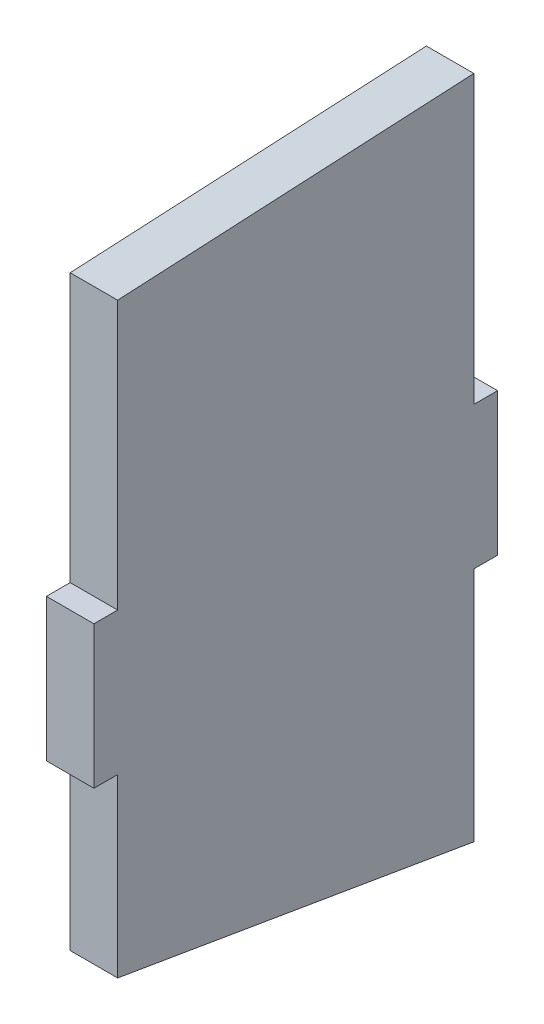
ISO-10303-21;
HEADER;
FILE_DESCRIPTION(('STEP AP214'),'2;1');
FILE_NAME('part.step','',(''),(''),'','','');
FILE_SCHEMA(('AUTOMOTIVE_DESIGN { 1 0 10303 214 1 1 1 1 }'));
ENDSEC;
DATA;
#1=APPLICATION_CONTEXT('core data for automotive mechanical design processes');
#2=APPLICATION_PROTOCOL_DEFINITION('international standard','automotive_design',2000,#1);
#3=PRODUCT_CONTEXT('',#1,'mechanical');
#4=PRODUCT('Part','Part','',(#3));
#5=PRODUCT_RELATED_PRODUCT_CATEGORY('part','',(#4));
#6=PRODUCT_DEFINITION_FORMATION('','',#4);
#7=PRODUCT_DEFINITION_CONTEXT('part definition',#1,'design');
#8=PRODUCT_DEFINITION('design','',#6,#7);
#9=PRODUCT_DEFINITION_SHAPE('','',#8);
#10=(LENGTH_UNIT() NAMED_UNIT(*) SI_UNIT(.MILLI.,.METRE.));
#11=(NAMED_UNIT(*) PLANE_ANGLE_UNIT() SI_UNIT($,.RADIAN.));
#12=(NAMED_UNIT(*) SI_UNIT($,.STERADIAN.) SOLID_ANGLE_UNIT());
#13=UNCERTAINTY_MEASURE_WITH_UNIT(LENGTH_MEASURE(1.E-05),#10,'distance_accuracy_value','');
#14=(GEOMETRIC_REPRESENTATION_CONTEXT(3) GLOBAL_UNCERTAINTY_ASSIGNED_CONTEXT((#13)) GLOBAL_UNIT_ASSIGNED_CONTEXT((#10,
#11,#12)) REPRESENTATION_CONTEXT('',''));
#15=CARTESIAN_POINT('',(0.,0.,0.));
#16=DIRECTION('',(0.,0.,1.));
#17=DIRECTION('',(1.,0.,0.));
#18=AXIS2_PLACEMENT_3D('',#15,#16,#17);
#19=CARTESIAN_POINT('',(25.4,0.,95.25));
#20=DIRECTION('',(0.,0.,1.));
#21=DIRECTION('',(1.,0.,0.));
#22=AXIS2_PLACEMENT_3D('',#19,#20,#21);
#23=PLANE('',#22);
#24=DIRECTION('',(0.,1.,0.));
#25=VECTOR('',#24,1.);
#26=CARTESIAN_POINT('',(0.,0.,95.25));
#27=LINE('',#26,#25);
#28=CARTESIAN_POINT('',(0.,38.1,95.25));
#29=VERTEX_POINT('',#28);
#30=CARTESIAN_POINT('',(0.,181.62487678,95.25));
#31=VERTEX_POINT('',#30);
#32=EDGE_CURVE('E159',#29,#31,#27,.T.);
#33=ORIENTED_EDGE('',*,*,#32,.F.);
#34=DIRECTION('',(-1.,0.,0.));
#35=VECTOR('',#34,1.);
#36=CARTESIAN_POINT('',(25.4,38.1,95.25));
#37=LINE('',#36,#35);
#38=CARTESIAN_POINT('',(25.4,38.1,95.25));
#39=VERTEX_POINT('',#38);
#40=EDGE_CURVE('E11',#39,#29,#37,.T.);
#41=ORIENTED_EDGE('',*,*,#40,.F.);
#42=DIRECTION('',(0.,1.,0.));
#43=VECTOR('',#42,1.);
#44=CARTESIAN_POINT('',(25.4,0.,95.25));
#45=LINE('',#44,#43);
#46=CARTESIAN_POINT('',(25.4,181.62487678,95.25));
#47=VERTEX_POINT('',#46);
#48=EDGE_CURVE('E188',#39,#47,#45,.T.);
#49=ORIENTED_EDGE('',*,*,#48,.T.);
#50=DIRECTION('',(-1.,0.,0.));
#51=VECTOR('',#50,1.);
#52=CARTESIAN_POINT('',(25.4,181.62487678,95.25));
#53=LINE('',#52,#51);
#54=EDGE_CURVE('E57',#47,#31,#53,.T.);
#55=ORIENTED_EDGE('',*,*,#54,.T.);
#56=EDGE_LOOP('',(#33,#41,#49,#55));
#57=FACE_BOUND('',#56,.T.);
#58=ADVANCED_FACE('F41',(#57),#23,.T.);
#59=CARTESIAN_POINT('',(25.4,38.1,0.));
#60=DIRECTION('',(0.,1.,0.));
#61=DIRECTION('',(0.,0.,1.));
#62=AXIS2_PLACEMENT_3D('',#59,#60,#61);
#63=PLANE('',#62);
#64=DIRECTION('',(0.,0.,-1.));
#65=VECTOR('',#64,1.);
#66=CARTESIAN_POINT('',(0.,38.1,0.));
#67=LINE('',#66,#65);
#68=CARTESIAN_POINT('',(0.,38.1,107.95));
#69=VERTEX_POINT('',#68);
#70=EDGE_CURVE('E161',#69,#29,#67,.T.);
#71=ORIENTED_EDGE('',*,*,#70,.F.);
#72=DIRECTION('',(-1.,0.,0.));
#73=VECTOR('',#72,1.);
#74=CARTESIAN_POINT('',(25.4,38.1,107.95));
#75=LINE('',#74,#73);
#76=CARTESIAN_POINT('',(25.4,38.1,107.95));
#77=VERTEX_POINT('',#76);
#78=EDGE_CURVE('E49',#77,#69,#75,.T.);
#79=ORIENTED_EDGE('',*,*,#78,.F.);
#80=DIRECTION('',(0.,0.,-1.));
#81=VECTOR('',#80,1.);
#82=CARTESIAN_POINT('',(25.4,38.1,0.));
#83=LINE('',#82,#81);
#84=EDGE_CURVE('E231',#77,#39,#83,.T.);
#85=ORIENTED_EDGE('',*,*,#84,.T.);
#86=ORIENTED_EDGE('',*,*,#40,.T.);
#87=EDGE_LOOP('',(#71,#79,#85,#86));
#88=FACE_BOUND('',#87,.T.);
#89=ADVANCED_FACE('F216',(#88),#63,.T.);
#90=CARTESIAN_POINT('',(25.4,0.,107.95));
#91=DIRECTION('',(0.,0.,1.));
#92=DIRECTION('',(1.,0.,0.));
#93=AXIS2_PLACEMENT_3D('',#90,#91,#92);
#94=PLANE('',#93);
#95=DIRECTION('',(0.,1.,0.));
#96=VECTOR('',#95,1.);
#97=CARTESIAN_POINT('',(0.,0.,107.95));
#98=LINE('',#97,#96);
#99=CARTESIAN_POINT('',(0.,-38.1,107.95));
#100=VERTEX_POINT('',#99);
#101=EDGE_CURVE('E164',#100,#69,#98,.T.);
#102=ORIENTED_EDGE('',*,*,#101,.F.);
#103=DIRECTION('',(-1.,0.,0.));
#104=VECTOR('',#103,1.);
#105=CARTESIAN_POINT('',(25.4,-38.1,107.95));
#106=LINE('',#105,#104);
#107=CARTESIAN_POINT('',(25.4,-38.1,107.95));
#108=VERTEX_POINT('',#107);
#109=EDGE_CURVE('E205',#108,#100,#106,.T.);
#110=ORIENTED_EDGE('',*,*,#109,.F.);
#111=DIRECTION('',(0.,1.,0.));
#112=VECTOR('',#111,1.);
#113=CARTESIAN_POINT('',(25.4,0.,107.95));
#114=LINE('',#113,#112);
#115=EDGE_CURVE('E212',#108,#77,#114,.T.);
#116=ORIENTED_EDGE('',*,*,#115,.T.);
#117=ORIENTED_EDGE('',*,*,#78,.T.);
#118=EDGE_LOOP('',(#102,#110,#116,#117));
#119=FACE_BOUND('',#118,.T.);
#120=ADVANCED_FACE('F210',(#119),#94,.T.);
#121=CARTESIAN_POINT('',(25.4,-38.1,0.));
#122=DIRECTION('',(0.,1.,0.));
#123=DIRECTION('',(0.,0.,1.));
#124=AXIS2_PLACEMENT_3D('',#121,#122,#123);
#125=PLANE('',#124);
#126=DIRECTION('',(0.,0.,-1.));
#127=VECTOR('',#126,1.);
#128=CARTESIAN_POINT('',(0.,-38.1,0.));
#129=LINE('',#128,#127);
#130=CARTESIAN_POINT('',(0.,-38.1,95.25));
#131=VERTEX_POINT('',#130);
#132=EDGE_CURVE('E167',#100,#131,#129,.T.);
#133=ORIENTED_EDGE('',*,*,#132,.T.);
#134=DIRECTION('',(-1.,0.,0.));
#135=VECTOR('',#134,1.);
#136=CARTESIAN_POINT('',(25.4,-38.1,95.25));
#137=LINE('',#136,#135);
#138=CARTESIAN_POINT('',(25.4,-38.1,95.25));
#139=VERTEX_POINT('',#138);
#140=EDGE_CURVE('E203',#139,#131,#137,.T.);
#141=ORIENTED_EDGE('',*,*,#140,.F.);
#142=DIRECTION('',(0.,0.,-1.));
#143=VECTOR('',#142,1.);
#144=CARTESIAN_POINT('',(25.4,-38.1,0.));
#145=LINE('',#144,#143);
#146=EDGE_CURVE('E227',#108,#139,#145,.T.);
#147=ORIENTED_EDGE('',*,*,#146,.F.);
#148=ORIENTED_EDGE('',*,*,#109,.T.);
#149=EDGE_LOOP('',(#133,#141,#147,#148));
#150=FACE_BOUND('',#149,.T.);
#151=ADVANCED_FACE('F224',(#150),#125,.F.);
#152=CARTESIAN_POINT('',(25.4,0.,95.25));
#153=DIRECTION('',(0.,0.,1.));
#154=DIRECTION('',(1.,0.,0.));
#155=AXIS2_PLACEMENT_3D('',#152,#153,#154);
#156=PLANE('',#155);
#157=DIRECTION('',(0.,1.,0.));
#158=VECTOR('',#157,1.);
#159=CARTESIAN_POINT('',(0.,0.,95.25));
#160=LINE('',#159,#158);
#161=CARTESIAN_POINT('',(0.,-132.320724436,95.25));
#162=VERTEX_POINT('',#161);
#163=EDGE_CURVE('E170',#162,#131,#160,.T.);
#164=ORIENTED_EDGE('',*,*,#163,.F.);
#165=DIRECTION('',(-1.,0.,0.));
#166=VECTOR('',#165,1.);
#167=CARTESIAN_POINT('',(25.4,-132.320724436,95.25));
#168=LINE('',#167,#166);
#169=CARTESIAN_POINT('',(25.4,-132.320724436,95.25));
#170=VERTEX_POINT('',#169);
#171=EDGE_CURVE('E201',#170,#162,#168,.T.);
#172=ORIENTED_EDGE('',*,*,#171,.F.);
#173=DIRECTION('',(0.,1.,0.));
#174=VECTOR('',#173,1.);
#175=CARTESIAN_POINT('',(25.4,0.,95.25));
#176=LINE('',#175,#174);
#177=EDGE_CURVE('E229',#170,#139,#176,.T.);
#178=ORIENTED_EDGE('',*,*,#177,.T.);
#179=ORIENTED_EDGE('',*,*,#140,.T.);
#180=EDGE_LOOP('',(#164,#172,#178,#179));
#181=FACE_BOUND('',#180,.T.);
#182=ADVANCED_FACE('F271',(#181),#156,.T.);
#183=CARTESIAN_POINT('',(25.4,-144.295184151635,24.3809952844578));
#184=DIRECTION('',(0.,0.986023786528564,-0.166604598975757));
#185=DIRECTION('',(0.,0.166604598975757,0.986023786528564));
#186=AXIS2_PLACEMENT_3D('',#183,#184,#185);
#187=PLANE('',#186);
#188=DIRECTION('',(0.,-0.166604598975757,-0.986023786528564));
#189=VECTOR('',#188,1.);
#190=CARTESIAN_POINT('',(0.,-144.295184151635,24.3809952844578));
#191=LINE('',#190,#189);
#192=CARTESIAN_POINT('',(0.,-164.508767502,-95.25));
#193=VERTEX_POINT('',#192);
#194=EDGE_CURVE('E173',#162,#193,#191,.T.);
#195=ORIENTED_EDGE('',*,*,#194,.T.);
#196=DIRECTION('',(-1.,0.,0.));
#197=VECTOR('',#196,1.);
#198=CARTESIAN_POINT('',(25.4,-164.508767502,-95.25));
#199=LINE('',#198,#197);
#200=CARTESIAN_POINT('',(25.4,-164.508767502,-95.25));
#201=VERTEX_POINT('',#200);
#202=EDGE_CURVE('E198',#201,#193,#199,.T.);
#203=ORIENTED_EDGE('',*,*,#202,.F.);
#204=DIRECTION('',(0.,-0.166604598975757,-0.986023786528564));
#205=VECTOR('',#204,1.);
#206=CARTESIAN_POINT('',(25.4,-144.295184151635,24.3809952844578));
#207=LINE('',#206,#205);
#208=EDGE_CURVE('E237',#170,#201,#207,.T.);
#209=ORIENTED_EDGE('',*,*,#208,.F.);
#210=ORIENTED_EDGE('',*,*,#171,.T.);
#211=EDGE_LOOP('',(#195,#203,#209,#210));
#212=FACE_BOUND('',#211,.T.);
#213=ADVANCED_FACE('F274',(#212),#187,.F.);
#214=CARTESIAN_POINT('',(25.4,0.,-95.25));
#215=DIRECTION('',(0.,0.,1.));
#216=DIRECTION('',(1.,0.,0.));
#217=AXIS2_PLACEMENT_3D('',#214,#215,#216);
#218=PLANE('',#217);
#219=DIRECTION('',(0.,1.,0.));
#220=VECTOR('',#219,1.);
#221=CARTESIAN_POINT('',(0.,0.,-95.25));
#222=LINE('',#221,#220);
#223=CARTESIAN_POINT('',(0.,-38.1,-95.25));
#224=VERTEX_POINT('',#223);
#225=EDGE_CURVE('E175',#193,#224,#222,.T.);
#226=ORIENTED_EDGE('',*,*,#225,.T.);
#227=DIRECTION('',(-1.,0.,0.));
#228=VECTOR('',#227,1.);
#229=CARTESIAN_POINT('',(25.4,-38.1,-95.25));
#230=LINE('',#229,#228);
#231=CARTESIAN_POINT('',(25.4,-38.1,-95.25));
#232=VERTEX_POINT('',#231);
#233=EDGE_CURVE('E195',#232,#224,#230,.T.);
#234=ORIENTED_EDGE('',*,*,#233,.F.);
#235=DIRECTION('',(0.,1.,0.));
#236=VECTOR('',#235,1.);
#237=CARTESIAN_POINT('',(25.4,0.,-95.25));
#238=LINE('',#237,#236);
#239=EDGE_CURVE('E239',#201,#232,#238,.T.);
#240=ORIENTED_EDGE('',*,*,#239,.F.);
#241=ORIENTED_EDGE('',*,*,#202,.T.);
#242=EDGE_LOOP('',(#226,#234,#240,#241));
#243=FACE_BOUND('',#242,.T.);
#244=ADVANCED_FACE('F278',(#243),#218,.F.);
#245=CARTESIAN_POINT('',(25.4,-38.1,0.));
#246=DIRECTION('',(0.,1.,0.));
#247=DIRECTION('',(0.,0.,1.));
#248=AXIS2_PLACEMENT_3D('',#245,#246,#247);
#249=PLANE('',#248);
#250=DIRECTION('',(0.,0.,-1.));
#251=VECTOR('',#250,1.);
#252=CARTESIAN_POINT('',(0.,-38.1,0.));
#253=LINE('',#252,#251);
#254=CARTESIAN_POINT('',(0.,-38.1,-107.95));
#255=VERTEX_POINT('',#254);
#256=EDGE_CURVE('E177',#224,#255,#253,.T.);
#257=ORIENTED_EDGE('',*,*,#256,.T.);
#258=DIRECTION('',(-1.,0.,0.));
#259=VECTOR('',#258,1.);
#260=CARTESIAN_POINT('',(25.4,-38.1,-107.95));
#261=LINE('',#260,#259);
#262=CARTESIAN_POINT('',(25.4,-38.1,-107.95));
#263=VERTEX_POINT('',#262);
#264=EDGE_CURVE('E192',#263,#255,#261,.T.);
#265=ORIENTED_EDGE('',*,*,#264,.F.);
#266=DIRECTION('',(0.,0.,-1.));
#267=VECTOR('',#266,1.);
#268=CARTESIAN_POINT('',(25.4,-38.1,0.));
#269=LINE('',#268,#267);
#270=EDGE_CURVE('E154',#232,#263,#269,.T.);
#271=ORIENTED_EDGE('',*,*,#270,.F.);
#272=ORIENTED_EDGE('',*,*,#233,.T.);
#273=EDGE_LOOP('',(#257,#265,#271,#272));
#274=FACE_BOUND('',#273,.T.);
#275=ADVANCED_FACE('F245',(#274),#249,.F.);
#276=CARTESIAN_POINT('',(25.4,0.,-107.95));
#277=DIRECTION('',(0.,0.,1.));
#278=DIRECTION('',(1.,0.,0.));
#279=AXIS2_PLACEMENT_3D('',#276,#277,#278);
#280=PLANE('',#279);
#281=DIRECTION('',(0.,1.,0.));
#282=VECTOR('',#281,1.);
#283=CARTESIAN_POINT('',(0.,0.,-107.95));
#284=LINE('',#283,#282);
#285=CARTESIAN_POINT('',(0.,38.1,-107.95));
#286=VERTEX_POINT('',#285);
#287=EDGE_CURVE('E179',#255,#286,#284,.T.);
#288=ORIENTED_EDGE('',*,*,#287,.T.);
#289=DIRECTION('',(-1.,0.,0.));
#290=VECTOR('',#289,1.);
#291=CARTESIAN_POINT('',(25.4,38.1,-107.95));
#292=LINE('',#291,#290);
#293=CARTESIAN_POINT('',(25.4,38.1,-107.95));
#294=VERTEX_POINT('',#293);
#295=EDGE_CURVE('E141',#294,#286,#292,.T.);
#296=ORIENTED_EDGE('',*,*,#295,.F.);
#297=DIRECTION('',(0.,1.,0.));
#298=VECTOR('',#297,1.);
#299=CARTESIAN_POINT('',(25.4,0.,-107.95));
#300=LINE('',#299,#298);
#301=EDGE_CURVE('E151',#263,#294,#300,.T.);
#302=ORIENTED_EDGE('',*,*,#301,.F.);
#303=ORIENTED_EDGE('',*,*,#264,.T.);
#304=EDGE_LOOP('',(#288,#296,#302,#303));
#305=FACE_BOUND('',#304,.T.);
#306=ADVANCED_FACE('F249',(#305),#280,.F.);
#307=CARTESIAN_POINT('',(25.4,38.1,0.));
#308=DIRECTION('',(0.,1.,0.));
#309=DIRECTION('',(0.,0.,1.));
#310=AXIS2_PLACEMENT_3D('',#307,#308,#309);
#311=PLANE('',#310);
#312=DIRECTION('',(0.,0.,-1.));
#313=VECTOR('',#312,1.);
#314=CARTESIAN_POINT('',(0.,38.1,0.));
#315=LINE('',#314,#313);
#316=CARTESIAN_POINT('',(0.,38.1,-95.25));
#317=VERTEX_POINT('',#316);
#318=EDGE_CURVE('E138',#317,#286,#315,.T.);
#319=ORIENTED_EDGE('',*,*,#318,.F.);
#320=DIRECTION('',(-1.,0.,0.));
#321=VECTOR('',#320,1.);
#322=CARTESIAN_POINT('',(25.4,38.1,-95.25));
#323=LINE('',#322,#321);
#324=CARTESIAN_POINT('',(25.4,38.1,-95.25));
#325=VERTEX_POINT('',#324);
#326=EDGE_CURVE('E132',#325,#317,#323,.T.);
#327=ORIENTED_EDGE('',*,*,#326,.F.);
#328=DIRECTION('',(0.,0.,-1.));
#329=VECTOR('',#328,1.);
#330=CARTESIAN_POINT('',(25.4,38.1,0.));
#331=LINE('',#330,#329);
#332=EDGE_CURVE('E136',#325,#294,#331,.T.);
#333=ORIENTED_EDGE('',*,*,#332,.T.);
#334=ORIENTED_EDGE('',*,*,#295,.T.);
#335=EDGE_LOOP('',(#319,#327,#333,#334));
#336=FACE_BOUND('',#335,.T.);
#337=ADVANCED_FACE('F134',(#336),#311,.T.);
#338=CARTESIAN_POINT('',(25.4,0.,-95.25));
#339=DIRECTION('',(0.,0.,1.));
#340=DIRECTION('',(1.,0.,0.));
#341=AXIS2_PLACEMENT_3D('',#338,#339,#340);
#342=PLANE('',#341);
#343=DIRECTION('',(0.,1.,0.));
#344=VECTOR('',#343,1.);
#345=CARTESIAN_POINT('',(0.,0.,-95.25));
#346=LINE('',#345,#344);
#347=CARTESIAN_POINT('',(0.,191.38745187,-95.25));
#348=VERTEX_POINT('',#347);
#349=EDGE_CURVE('E183',#317,#348,#346,.T.);
#350=ORIENTED_EDGE('',*,*,#349,.T.);
#351=DIRECTION('',(-1.,0.,0.));
#352=VECTOR('',#351,1.);
#353=CARTESIAN_POINT('',(25.4,191.38745187,-95.25));
#354=LINE('',#353,#352);
#355=CARTESIAN_POINT('',(25.4,191.38745187,-95.25));
#356=VERTEX_POINT('',#355);
#357=EDGE_CURVE('E95',#356,#348,#354,.T.);
#358=ORIENTED_EDGE('',*,*,#357,.F.);
#359=DIRECTION('',(0.,1.,0.));
#360=VECTOR('',#359,1.);
#361=CARTESIAN_POINT('',(25.4,0.,-95.25));
#362=LINE('',#361,#360);
#363=EDGE_CURVE('E143',#325,#356,#362,.T.);
#364=ORIENTED_EDGE('',*,*,#363,.F.);
#365=ORIENTED_EDGE('',*,*,#326,.T.);
#366=EDGE_LOOP('',(#350,#358,#364,#365));
#367=FACE_BOUND('',#366,.T.);
#368=ADVANCED_FACE('F144',(#367),#342,.F.);
#369=CARTESIAN_POINT('',(25.4,186.0176324253,9.53286669089769));
#370=DIRECTION('',(0.,0.99868944751847,0.0511799513017831));
#371=DIRECTION('',(0.,-0.0511799513017831,0.99868944751847));
#372=AXIS2_PLACEMENT_3D('',#369,#370,#371);
#373=PLANE('',#372);
#374=DIRECTION('',(0.,0.0511799513017831,-0.99868944751847));
#375=VECTOR('',#374,1.);
#376=CARTESIAN_POINT('',(0.,186.0176324253,9.53286669089769));
#377=LINE('',#376,#375);
#378=EDGE_CURVE('E185',#31,#348,#377,.T.);
#379=ORIENTED_EDGE('',*,*,#378,.F.);
#380=ORIENTED_EDGE('',*,*,#54,.F.);
#381=DIRECTION('',(0.,0.0511799513017831,-0.99868944751847));
#382=VECTOR('',#381,1.);
#383=CARTESIAN_POINT('',(25.4,186.0176324253,9.53286669089769));
#384=LINE('',#383,#382);
#385=EDGE_CURVE('E147',#47,#356,#384,.T.);
#386=ORIENTED_EDGE('',*,*,#385,.T.);
#387=ORIENTED_EDGE('',*,*,#357,.T.);
#388=EDGE_LOOP('',(#379,#380,#386,#387));
#389=FACE_BOUND('',#388,.T.);
#390=ADVANCED_FACE('F250',(#389),#373,.T.);
#391=CARTESIAN_POINT('',(25.4,0.,0.));
#392=DIRECTION('',(1.,0.,0.));
#393=DIRECTION('',(0.,0.,-1.));
#394=AXIS2_PLACEMENT_3D('',#391,#392,#393);
#395=PLANE('',#394);
#396=ORIENTED_EDGE('',*,*,#48,.F.);
#397=ORIENTED_EDGE('',*,*,#84,.F.);
#398=ORIENTED_EDGE('',*,*,#115,.F.);
#399=ORIENTED_EDGE('',*,*,#146,.T.);
#400=ORIENTED_EDGE('',*,*,#177,.F.);
#401=ORIENTED_EDGE('',*,*,#208,.T.);
#402=ORIENTED_EDGE('',*,*,#239,.T.);
#403=ORIENTED_EDGE('',*,*,#270,.T.);
#404=ORIENTED_EDGE('',*,*,#301,.T.);
#405=ORIENTED_EDGE('',*,*,#332,.F.);
#406=ORIENTED_EDGE('',*,*,#363,.T.);
#407=ORIENTED_EDGE('',*,*,#385,.F.);
#408=EDGE_LOOP('',(#396,#397,#398,#399,#400,#401,#402,#403,#404,#405,#406,#407));
#409=FACE_BOUND('',#408,.T.);
#410=ADVANCED_FACE('F149',(#409),#395,.T.);
#411=CARTESIAN_POINT('',(0.,0.,0.));
#412=DIRECTION('',(1.,0.,0.));
#413=DIRECTION('',(0.,0.,-1.));
#414=AXIS2_PLACEMENT_3D('',#411,#412,#413);
#415=PLANE('',#414);
#416=ORIENTED_EDGE('',*,*,#32,.T.);
#417=ORIENTED_EDGE('',*,*,#378,.T.);
#418=ORIENTED_EDGE('',*,*,#349,.F.);
#419=ORIENTED_EDGE('',*,*,#318,.T.);
#420=ORIENTED_EDGE('',*,*,#287,.F.);
#421=ORIENTED_EDGE('',*,*,#256,.F.);
#422=ORIENTED_EDGE('',*,*,#225,.F.);
#423=ORIENTED_EDGE('',*,*,#194,.F.);
#424=ORIENTED_EDGE('',*,*,#163,.T.);
#425=ORIENTED_EDGE('',*,*,#132,.F.);
#426=ORIENTED_EDGE('',*,*,#101,.T.);
#427=ORIENTED_EDGE('',*,*,#70,.T.);
#428=EDGE_LOOP('',(#416,#417,#418,#419,#420,#421,#422,#423,#424,#425,#426,#427));
#429=FACE_BOUND('',#428,.T.);
#430=ADVANCED_FACE('F219',(#429),#415,.F.);
#431=CLOSED_SHELL('',(#58,#89,#120,#151,#182,#213,#244,#275,#306,#337,#368,#390,#410,#430));
#432=MANIFOLD_SOLID_BREP('B2',#431);
#433=ADVANCED_BREP_SHAPE_REPRESENTATION('',(#18,#432),#14);
#434=SHAPE_DEFINITION_REPRESENTATION(#9,#433);
ENDSEC;
END-ISO-10303-21;
